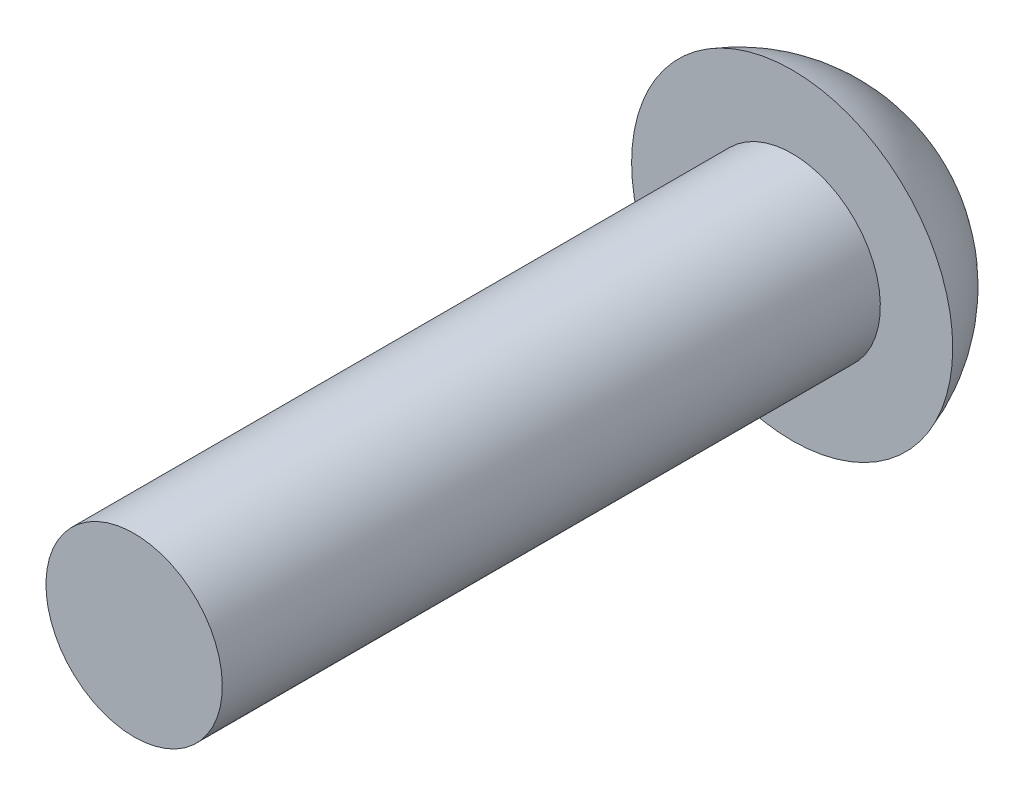
ISO-10303-21;
HEADER;
FILE_DESCRIPTION(('STEP AP214'),'2;1');
FILE_NAME('part.step','',(''),(''),'','','');
FILE_SCHEMA(('AUTOMOTIVE_DESIGN { 1 0 10303 214 1 1 1 1 }'));
ENDSEC;
DATA;
#1=APPLICATION_CONTEXT('core data for automotive mechanical design processes');
#2=APPLICATION_PROTOCOL_DEFINITION('international standard','automotive_design',2000,#1);
#3=PRODUCT_CONTEXT('',#1,'mechanical');
#4=PRODUCT('Part','Part','',(#3));
#5=PRODUCT_RELATED_PRODUCT_CATEGORY('part','',(#4));
#6=PRODUCT_DEFINITION_FORMATION('','',#4);
#7=PRODUCT_DEFINITION_CONTEXT('part definition',#1,'design');
#8=PRODUCT_DEFINITION('design','',#6,#7);
#9=PRODUCT_DEFINITION_SHAPE('','',#8);
#10=(LENGTH_UNIT() NAMED_UNIT(*) SI_UNIT(.MILLI.,.METRE.));
#11=(NAMED_UNIT(*) PLANE_ANGLE_UNIT() SI_UNIT($,.RADIAN.));
#12=(NAMED_UNIT(*) SI_UNIT($,.STERADIAN.) SOLID_ANGLE_UNIT());
#13=UNCERTAINTY_MEASURE_WITH_UNIT(LENGTH_MEASURE(1.E-05),#10,'distance_accuracy_value','');
#14=(GEOMETRIC_REPRESENTATION_CONTEXT(3) GLOBAL_UNCERTAINTY_ASSIGNED_CONTEXT((#13)) GLOBAL_UNIT_ASSIGNED_CONTEXT((#10,
#11,#12)) REPRESENTATION_CONTEXT('',''));
#15=CARTESIAN_POINT('',(0.,0.,0.));
#16=DIRECTION('',(0.,0.,1.));
#17=DIRECTION('',(1.,0.,0.));
#18=AXIS2_PLACEMENT_3D('',#15,#16,#17);
#19=CARTESIAN_POINT('',(0.,0.,-11.6695681818182));
#20=DIRECTION('',(0.,0.,1.));
#21=DIRECTION('',(0.,1.,0.));
#22=AXIS2_PLACEMENT_3D('',#19,#20,#21);
#23=SPHERICAL_SURFACE('',#22,3.26563181818182);
#24=CARTESIAN_POINT('',(0.,0.,-12.7));
#25=DIRECTION('',(0.,0.,1.));
#26=DIRECTION('',(0.,-1.,0.));
#27=AXIS2_PLACEMENT_3D('',#24,#25,#26);
#28=CIRCLE('',#27,3.0988);
#29=CARTESIAN_POINT('',(0.,-3.0988,-12.7));
#30=VERTEX_POINT('',#29);
#31=EDGE_CURVE('E10',#30,#30,#28,.T.);
#32=ORIENTED_EDGE('',*,*,#31,.F.);
#33=EDGE_LOOP('',(#32));
#34=FACE_BOUND('',#33,.T.);
#35=ADVANCED_FACE('F358',(#34),#23,.T.);
#36=CARTESIAN_POINT('',(0.,1.7018,-12.7));
#37=DIRECTION('',(0.,0.,-1.));
#38=DIRECTION('',(0.,1.,0.));
#39=AXIS2_PLACEMENT_3D('',#36,#37,#38);
#40=PLANE('',#39);
#41=CARTESIAN_POINT('',(0.,0.,-12.7));
#42=DIRECTION('',(0.,0.,1.));
#43=DIRECTION('',(0.,-1.,0.));
#44=AXIS2_PLACEMENT_3D('',#41,#42,#43);
#45=CIRCLE('',#44,1.7018);
#46=CARTESIAN_POINT('',(0.,-1.7018,-12.7));
#47=VERTEX_POINT('',#46);
#48=EDGE_CURVE('E364',#47,#47,#45,.T.);
#49=ORIENTED_EDGE('',*,*,#48,.F.);
#50=EDGE_LOOP('',(#49));
#51=FACE_BOUND('',#50,.T.);
#52=ORIENTED_EDGE('',*,*,#31,.T.);
#53=EDGE_LOOP('',(#52));
#54=FACE_BOUND('',#53,.T.);
#55=ADVANCED_FACE('F379',(#51,#54),#40,.F.);
#56=CARTESIAN_POINT('',(0.,0.,0.));
#57=DIRECTION('',(0.,0.,1.));
#58=DIRECTION('',(0.,-1.,0.));
#59=AXIS2_PLACEMENT_3D('',#56,#57,#58);
#60=CYLINDRICAL_SURFACE('',#59,1.7018);
#61=CARTESIAN_POINT('',(0.,0.,0.));
#62=DIRECTION('',(0.,0.,1.));
#63=DIRECTION('',(0.,-1.,0.));
#64=AXIS2_PLACEMENT_3D('',#61,#62,#63);
#65=CIRCLE('',#64,1.7018);
#66=CARTESIAN_POINT('',(0.,-1.7018,0.));
#67=VERTEX_POINT('',#66);
#68=EDGE_CURVE('E368',#67,#67,#65,.T.);
#69=ORIENTED_EDGE('',*,*,#68,.F.);
#70=EDGE_LOOP('',(#69));
#71=FACE_BOUND('',#70,.T.);
#72=ORIENTED_EDGE('',*,*,#48,.T.);
#73=EDGE_LOOP('',(#72));
#74=FACE_BOUND('',#73,.T.);
#75=ADVANCED_FACE('F377',(#71,#74),#60,.T.);
#76=CARTESIAN_POINT('',(0.,0.,0.));
#77=DIRECTION('',(0.,0.,-1.));
#78=DIRECTION('',(0.,1.,0.));
#79=AXIS2_PLACEMENT_3D('',#76,#77,#78);
#80=PLANE('',#79);
#81=ORIENTED_EDGE('',*,*,#68,.T.);
#82=EDGE_LOOP('',(#81));
#83=FACE_BOUND('',#82,.T.);
#84=ADVANCED_FACE('F375',(#83),#80,.F.);
#85=CLOSED_SHELL('',(#35,#55,#75,#84));
#86=MANIFOLD_SOLID_BREP('B2',#85);
#87=ADVANCED_BREP_SHAPE_REPRESENTATION('',(#18,#86),#14);
#88=SHAPE_DEFINITION_REPRESENTATION(#9,#87);
ENDSEC;
END-ISO-10303-21;
